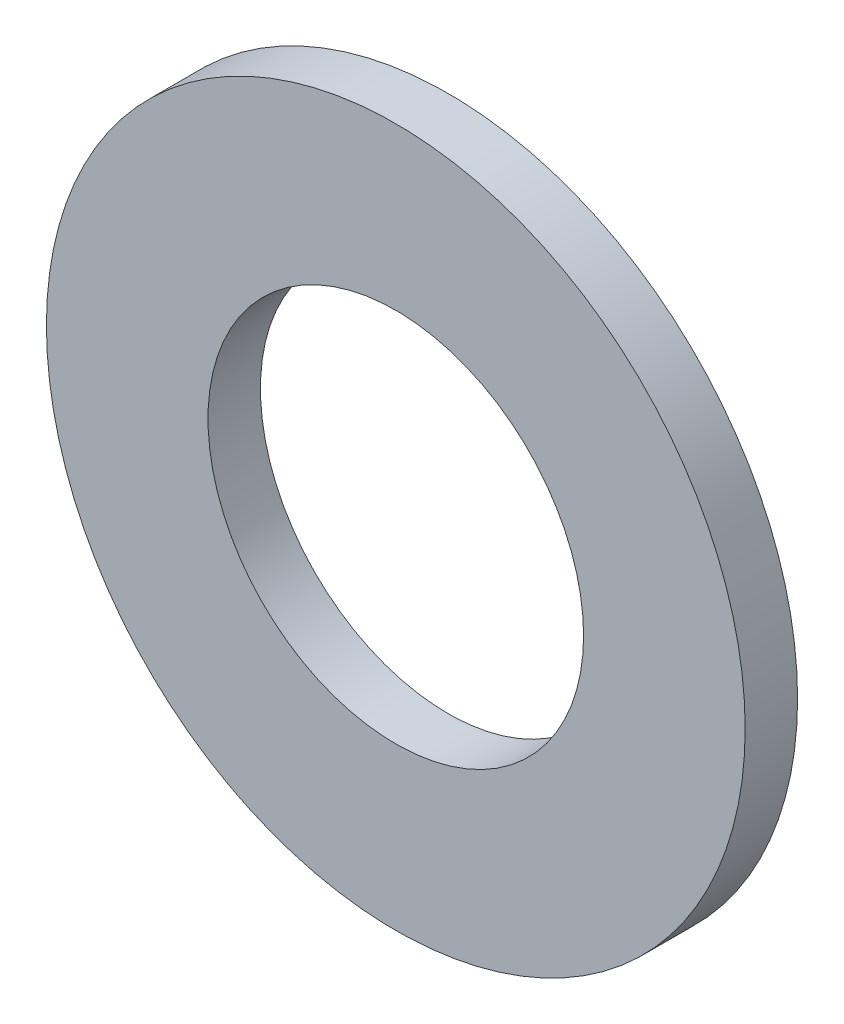
ISO-10303-21;
HEADER;
FILE_DESCRIPTION(('STEP AP214'),'2;1');
FILE_NAME('part.step','',(''),(''),'','','');
FILE_SCHEMA(('AUTOMOTIVE_DESIGN { 1 0 10303 214 1 1 1 1 }'));
ENDSEC;
DATA;
#1=APPLICATION_CONTEXT('core data for automotive mechanical design processes');
#2=APPLICATION_PROTOCOL_DEFINITION('international standard','automotive_design',2000,#1);
#3=PRODUCT_CONTEXT('',#1,'mechanical');
#4=PRODUCT('Part','Part','',(#3));
#5=PRODUCT_RELATED_PRODUCT_CATEGORY('part','',(#4));
#6=PRODUCT_DEFINITION_FORMATION('','',#4);
#7=PRODUCT_DEFINITION_CONTEXT('part definition',#1,'design');
#8=PRODUCT_DEFINITION('design','',#6,#7);
#9=PRODUCT_DEFINITION_SHAPE('','',#8);
#10=(LENGTH_UNIT() NAMED_UNIT(*) SI_UNIT(.MILLI.,.METRE.));
#11=(NAMED_UNIT(*) PLANE_ANGLE_UNIT() SI_UNIT($,.RADIAN.));
#12=(NAMED_UNIT(*) SI_UNIT($,.STERADIAN.) SOLID_ANGLE_UNIT());
#13=UNCERTAINTY_MEASURE_WITH_UNIT(LENGTH_MEASURE(1.E-05),#10,'distance_accuracy_value','');
#14=(GEOMETRIC_REPRESENTATION_CONTEXT(3) GLOBAL_UNCERTAINTY_ASSIGNED_CONTEXT((#13)) GLOBAL_UNIT_ASSIGNED_CONTEXT((#10,
#11,#12)) REPRESENTATION_CONTEXT('',''));
#15=CARTESIAN_POINT('',(0.,0.,0.));
#16=DIRECTION('',(0.,0.,1.));
#17=DIRECTION('',(1.,0.,0.));
#18=AXIS2_PLACEMENT_3D('',#15,#16,#17);
#19=CARTESIAN_POINT('',(0.,0.,0.6));
#20=DIRECTION('',(0.,0.,1.));
#21=DIRECTION('',(1.,0.,0.));
#22=AXIS2_PLACEMENT_3D('',#19,#20,#21);
#23=PLANE('',#22);
#24=CARTESIAN_POINT('',(0.,0.,0.6));
#25=DIRECTION('',(0.,0.,1.));
#26=DIRECTION('',(1.,0.,0.));
#27=AXIS2_PLACEMENT_3D('',#24,#25,#26);
#28=CIRCLE('',#27,4.);
#29=CARTESIAN_POINT('',(4.,0.,0.6));
#30=VERTEX_POINT('',#29);
#31=EDGE_CURVE('E10',#30,#30,#28,.T.);
#32=ORIENTED_EDGE('',*,*,#31,.T.);
#33=EDGE_LOOP('',(#32));
#34=FACE_BOUND('',#33,.T.);
#35=CARTESIAN_POINT('',(0.,0.,0.6));
#36=DIRECTION('',(0.,0.,1.));
#37=DIRECTION('',(1.,0.,0.));
#38=AXIS2_PLACEMENT_3D('',#35,#36,#37);
#39=CIRCLE('',#38,2.15);
#40=CARTESIAN_POINT('',(2.15,0.,0.6));
#41=VERTEX_POINT('',#40);
#42=EDGE_CURVE('E41',#41,#41,#39,.T.);
#43=ORIENTED_EDGE('',*,*,#42,.F.);
#44=EDGE_LOOP('',(#43));
#45=FACE_BOUND('',#44,.T.);
#46=ADVANCED_FACE('F30',(#34,#45),#23,.T.);
#47=CARTESIAN_POINT('',(0.,0.,0.));
#48=DIRECTION('',(0.,0.,1.));
#49=DIRECTION('',(1.,0.,0.));
#50=AXIS2_PLACEMENT_3D('',#47,#48,#49);
#51=PLANE('',#50);
#52=CARTESIAN_POINT('',(0.,0.,0.));
#53=DIRECTION('',(0.,0.,1.));
#54=DIRECTION('',(1.,0.,0.));
#55=AXIS2_PLACEMENT_3D('',#52,#53,#54);
#56=CIRCLE('',#55,4.);
#57=CARTESIAN_POINT('',(4.,0.,0.));
#58=VERTEX_POINT('',#57);
#59=EDGE_CURVE('E34',#58,#58,#56,.T.);
#60=ORIENTED_EDGE('',*,*,#59,.F.);
#61=EDGE_LOOP('',(#60));
#62=FACE_BOUND('',#61,.T.);
#63=CARTESIAN_POINT('',(0.,0.,0.));
#64=DIRECTION('',(0.,0.,1.));
#65=DIRECTION('',(1.,0.,0.));
#66=AXIS2_PLACEMENT_3D('',#63,#64,#65);
#67=CIRCLE('',#66,2.15);
#68=CARTESIAN_POINT('',(2.15,0.,0.));
#69=VERTEX_POINT('',#68);
#70=EDGE_CURVE('E43',#69,#69,#67,.T.);
#71=ORIENTED_EDGE('',*,*,#70,.T.);
#72=EDGE_LOOP('',(#71));
#73=FACE_BOUND('',#72,.T.);
#74=ADVANCED_FACE('F53',(#62,#73),#51,.F.);
#75=CARTESIAN_POINT('',(0.,0.,0.6));
#76=DIRECTION('',(0.,0.,-1.));
#77=DIRECTION('',(-1.,0.,0.));
#78=AXIS2_PLACEMENT_3D('',#75,#76,#77);
#79=CYLINDRICAL_SURFACE('',#78,4.);
#80=ORIENTED_EDGE('',*,*,#31,.F.);
#81=EDGE_LOOP('',(#80));
#82=FACE_BOUND('',#81,.T.);
#83=ORIENTED_EDGE('',*,*,#59,.T.);
#84=EDGE_LOOP('',(#83));
#85=FACE_BOUND('',#84,.T.);
#86=ADVANCED_FACE('F32',(#82,#85),#79,.T.);
#87=CARTESIAN_POINT('',(0.,0.,0.6));
#88=DIRECTION('',(0.,0.,-1.));
#89=DIRECTION('',(-1.,0.,0.));
#90=AXIS2_PLACEMENT_3D('',#87,#88,#89);
#91=CYLINDRICAL_SURFACE('',#90,2.15);
#92=ORIENTED_EDGE('',*,*,#42,.T.);
#93=EDGE_LOOP('',(#92));
#94=FACE_BOUND('',#93,.T.);
#95=ORIENTED_EDGE('',*,*,#70,.F.);
#96=EDGE_LOOP('',(#95));
#97=FACE_BOUND('',#96,.T.);
#98=ADVANCED_FACE('F49',(#94,#97),#91,.F.);
#99=CLOSED_SHELL('',(#46,#74,#86,#98));
#100=MANIFOLD_SOLID_BREP('B2',#99);
#101=ADVANCED_BREP_SHAPE_REPRESENTATION('',(#18,#100),#14);
#102=SHAPE_DEFINITION_REPRESENTATION(#9,#101);
ENDSEC;
END-ISO-10303-21;
